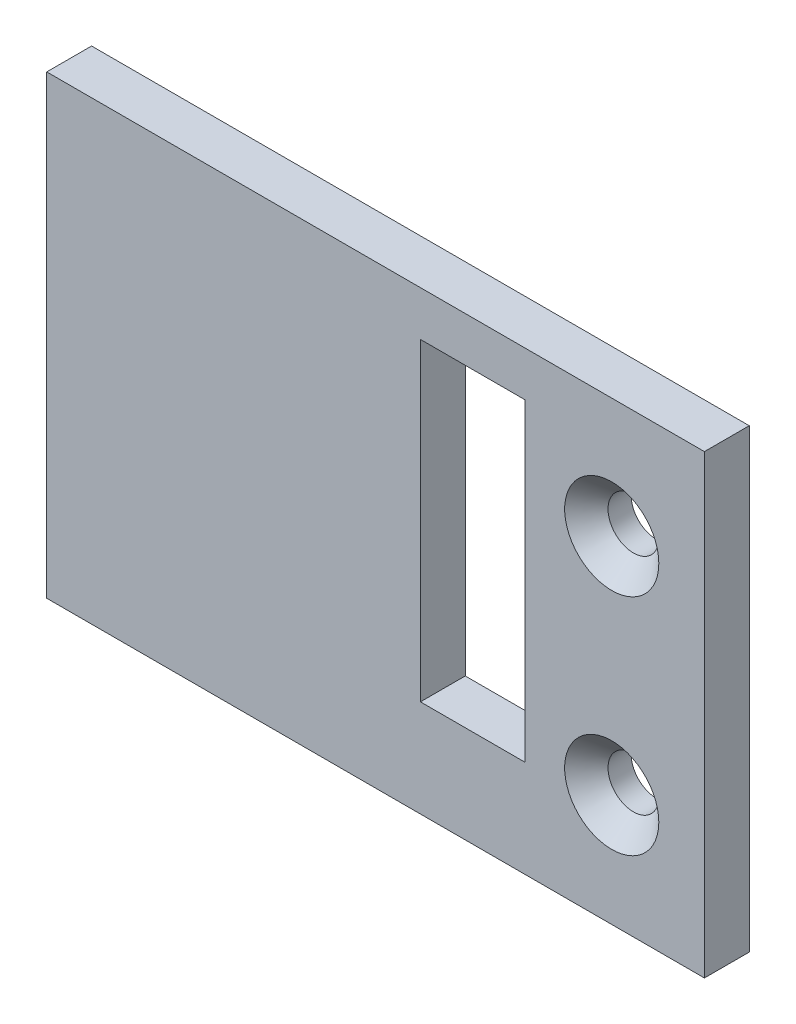
ISO-10303-21;
HEADER;
FILE_DESCRIPTION(('STEP AP214'),'2;1');
FILE_NAME('part.step','',(''),(''),'','','');
FILE_SCHEMA(('AUTOMOTIVE_DESIGN { 1 0 10303 214 1 1 1 1 }'));
ENDSEC;
DATA;
#1=APPLICATION_CONTEXT('core data for automotive mechanical design processes');
#2=APPLICATION_PROTOCOL_DEFINITION('international standard','automotive_design',2000,#1);
#3=PRODUCT_CONTEXT('',#1,'mechanical');
#4=PRODUCT('Part','Part','',(#3));
#5=PRODUCT_RELATED_PRODUCT_CATEGORY('part','',(#4));
#6=PRODUCT_DEFINITION_FORMATION('','',#4);
#7=PRODUCT_DEFINITION_CONTEXT('part definition',#1,'design');
#8=PRODUCT_DEFINITION('design','',#6,#7);
#9=PRODUCT_DEFINITION_SHAPE('','',#8);
#10=(LENGTH_UNIT() NAMED_UNIT(*) SI_UNIT(.MILLI.,.METRE.));
#11=(NAMED_UNIT(*) PLANE_ANGLE_UNIT() SI_UNIT($,.RADIAN.));
#12=(NAMED_UNIT(*) SI_UNIT($,.STERADIAN.) SOLID_ANGLE_UNIT());
#13=UNCERTAINTY_MEASURE_WITH_UNIT(LENGTH_MEASURE(1.E-05),#10,'distance_accuracy_value','');
#14=(GEOMETRIC_REPRESENTATION_CONTEXT(3) GLOBAL_UNCERTAINTY_ASSIGNED_CONTEXT((#13)) GLOBAL_UNIT_ASSIGNED_CONTEXT((#10,
#11,#12)) REPRESENTATION_CONTEXT('',''));
#15=CARTESIAN_POINT('',(0.,0.,0.));
#16=DIRECTION('',(0.,0.,1.));
#17=DIRECTION('',(1.,0.,0.));
#18=AXIS2_PLACEMENT_3D('',#15,#16,#17);
#19=CARTESIAN_POINT('',(6.00000000000003,0.,3.));
#20=DIRECTION('',(1.,0.,0.));
#21=DIRECTION('',(0.,0.,-1.));
#22=AXIS2_PLACEMENT_3D('',#19,#20,#21);
#23=PLANE('',#22);
#24=DIRECTION('',(0.,-1.,0.));
#25=VECTOR('',#24,1.);
#26=CARTESIAN_POINT('',(6.00000000000003,0.,0.));
#27=LINE('',#26,#25);
#28=CARTESIAN_POINT('',(6.00000000000003,15.2500000000001,0.));
#29=VERTEX_POINT('',#28);
#30=CARTESIAN_POINT('',(6.00000000000003,-15.2499999999999,0.));
#31=VERTEX_POINT('',#30);
#32=EDGE_CURVE('E140',#29,#31,#27,.T.);
#33=ORIENTED_EDGE('',*,*,#32,.F.);
#34=DIRECTION('',(0.,0.,-1.));
#35=VECTOR('',#34,1.);
#36=CARTESIAN_POINT('',(6.00000000000003,15.2500000000001,3.));
#37=LINE('',#36,#35);
#38=CARTESIAN_POINT('',(6.00000000000003,15.2500000000001,3.));
#39=VERTEX_POINT('',#38);
#40=EDGE_CURVE('E11',#39,#29,#37,.T.);
#41=ORIENTED_EDGE('',*,*,#40,.F.);
#42=DIRECTION('',(0.,-1.,0.));
#43=VECTOR('',#42,1.);
#44=CARTESIAN_POINT('',(6.00000000000003,0.,3.));
#45=LINE('',#44,#43);
#46=CARTESIAN_POINT('',(6.00000000000003,-15.2499999999999,3.));
#47=VERTEX_POINT('',#46);
#48=EDGE_CURVE('E112',#39,#47,#45,.T.);
#49=ORIENTED_EDGE('',*,*,#48,.T.);
#50=DIRECTION('',(0.,0.,-1.));
#51=VECTOR('',#50,1.);
#52=CARTESIAN_POINT('',(6.00000000000003,-15.2499999999999,3.));
#53=LINE('',#52,#51);
#54=EDGE_CURVE('E52',#47,#31,#53,.T.);
#55=ORIENTED_EDGE('',*,*,#54,.T.);
#56=EDGE_LOOP('',(#33,#41,#49,#55));
#57=FACE_BOUND('',#56,.T.);
#58=ADVANCED_FACE('F33',(#57),#23,.T.);
#59=CARTESIAN_POINT('',(0.,15.2500000000001,3.));
#60=DIRECTION('',(0.,-1.,0.));
#61=DIRECTION('',(1.,0.,0.));
#62=AXIS2_PLACEMENT_3D('',#59,#60,#61);
#63=PLANE('',#62);
#64=DIRECTION('',(-1.,0.,0.));
#65=VECTOR('',#64,1.);
#66=CARTESIAN_POINT('',(0.,15.2500000000001,0.));
#67=LINE('',#66,#65);
#68=CARTESIAN_POINT('',(-38.,15.2500000000001,0.));
#69=VERTEX_POINT('',#68);
#70=EDGE_CURVE('E118',#29,#69,#67,.T.);
#71=ORIENTED_EDGE('',*,*,#70,.T.);
#72=DIRECTION('',(0.,0.,-1.));
#73=VECTOR('',#72,1.);
#74=CARTESIAN_POINT('',(-38.,15.2500000000001,3.));
#75=LINE('',#74,#73);
#76=CARTESIAN_POINT('',(-38.,15.2500000000001,3.));
#77=VERTEX_POINT('',#76);
#78=EDGE_CURVE('E43',#77,#69,#75,.T.);
#79=ORIENTED_EDGE('',*,*,#78,.F.);
#80=DIRECTION('',(-1.,0.,0.));
#81=VECTOR('',#80,1.);
#82=CARTESIAN_POINT('',(0.,15.2500000000001,3.));
#83=LINE('',#82,#81);
#84=EDGE_CURVE('E106',#39,#77,#83,.T.);
#85=ORIENTED_EDGE('',*,*,#84,.F.);
#86=ORIENTED_EDGE('',*,*,#40,.T.);
#87=EDGE_LOOP('',(#71,#79,#85,#86));
#88=FACE_BOUND('',#87,.T.);
#89=ADVANCED_FACE('F116',(#88),#63,.F.);
#90=CARTESIAN_POINT('',(-38.,0.,3.));
#91=DIRECTION('',(-1.,0.,0.));
#92=DIRECTION('',(0.,0.,1.));
#93=AXIS2_PLACEMENT_3D('',#90,#91,#92);
#94=PLANE('',#93);
#95=DIRECTION('',(0.,1.,0.));
#96=VECTOR('',#95,1.);
#97=CARTESIAN_POINT('',(-38.,0.,0.));
#98=LINE('',#97,#96);
#99=CARTESIAN_POINT('',(-38.,-15.2499999999999,0.));
#100=VERTEX_POINT('',#99);
#101=EDGE_CURVE('E143',#100,#69,#98,.T.);
#102=ORIENTED_EDGE('',*,*,#101,.F.);
#103=DIRECTION('',(0.,0.,-1.));
#104=VECTOR('',#103,1.);
#105=CARTESIAN_POINT('',(-38.,-15.2499999999999,3.));
#106=LINE('',#105,#104);
#107=CARTESIAN_POINT('',(-38.,-15.2499999999999,3.));
#108=VERTEX_POINT('',#107);
#109=EDGE_CURVE('E77',#108,#100,#106,.T.);
#110=ORIENTED_EDGE('',*,*,#109,.F.);
#111=DIRECTION('',(0.,1.,0.));
#112=VECTOR('',#111,1.);
#113=CARTESIAN_POINT('',(-38.,0.,3.));
#114=LINE('',#113,#112);
#115=EDGE_CURVE('E111',#108,#77,#114,.T.);
#116=ORIENTED_EDGE('',*,*,#115,.T.);
#117=ORIENTED_EDGE('',*,*,#78,.T.);
#118=EDGE_LOOP('',(#102,#110,#116,#117));
#119=FACE_BOUND('',#118,.T.);
#120=ADVANCED_FACE('F122',(#119),#94,.T.);
#121=CARTESIAN_POINT('',(0.,12.2500000000001,3.));
#122=DIRECTION('',(0.,-1.,0.));
#123=DIRECTION('',(1.,0.,0.));
#124=AXIS2_PLACEMENT_3D('',#121,#122,#123);
#125=PLANE('',#124);
#126=DIRECTION('',(-1.,0.,0.));
#127=VECTOR('',#126,1.);
#128=CARTESIAN_POINT('',(0.,12.2500000000001,0.));
#129=LINE('',#128,#127);
#130=CARTESIAN_POINT('',(-5.99999999999997,12.2500000000001,0.));
#131=VERTEX_POINT('',#130);
#132=CARTESIAN_POINT('',(-13.,12.2500000000001,0.));
#133=VERTEX_POINT('',#132);
#134=EDGE_CURVE('E129',#131,#133,#129,.T.);
#135=ORIENTED_EDGE('',*,*,#134,.F.);
#136=DIRECTION('',(0.,0.,-1.));
#137=VECTOR('',#136,1.);
#138=CARTESIAN_POINT('',(-5.99999999999997,12.2500000000001,3.));
#139=LINE('',#138,#137);
#140=CARTESIAN_POINT('',(-5.99999999999997,12.2500000000001,3.));
#141=VERTEX_POINT('',#140);
#142=EDGE_CURVE('E37',#141,#131,#139,.T.);
#143=ORIENTED_EDGE('',*,*,#142,.F.);
#144=DIRECTION('',(-1.,0.,0.));
#145=VECTOR('',#144,1.);
#146=CARTESIAN_POINT('',(0.,12.2500000000001,3.));
#147=LINE('',#146,#145);
#148=CARTESIAN_POINT('',(-13.,12.2500000000001,3.));
#149=VERTEX_POINT('',#148);
#150=EDGE_CURVE('E148',#141,#149,#147,.T.);
#151=ORIENTED_EDGE('',*,*,#150,.T.);
#152=DIRECTION('',(0.,0.,-1.));
#153=VECTOR('',#152,1.);
#154=CARTESIAN_POINT('',(-13.,12.2500000000001,3.));
#155=LINE('',#154,#153);
#156=EDGE_CURVE('E125',#149,#133,#155,.T.);
#157=ORIENTED_EDGE('',*,*,#156,.T.);
#158=EDGE_LOOP('',(#135,#143,#151,#157));
#159=FACE_BOUND('',#158,.T.);
#160=ADVANCED_FACE('F35',(#159),#125,.T.);
#161=CARTESIAN_POINT('',(-5.99999999999995,0.,3.));
#162=DIRECTION('',(1.,0.,0.));
#163=DIRECTION('',(0.,1.,0.));
#164=AXIS2_PLACEMENT_3D('',#161,#162,#163);
#165=PLANE('',#164);
#166=DIRECTION('',(0.,-1.,0.));
#167=VECTOR('',#166,1.);
#168=CARTESIAN_POINT('',(-5.99999999999995,0.,0.));
#169=LINE('',#168,#167);
#170=CARTESIAN_POINT('',(-5.99999999999993,-8.74999999999988,0.));
#171=VERTEX_POINT('',#170);
#172=EDGE_CURVE('E132',#131,#171,#169,.T.);
#173=ORIENTED_EDGE('',*,*,#172,.T.);
#174=DIRECTION('',(0.,0.,-1.));
#175=VECTOR('',#174,1.);
#176=CARTESIAN_POINT('',(-5.99999999999993,-8.74999999999988,3.));
#177=LINE('',#176,#175);
#178=CARTESIAN_POINT('',(-5.99999999999993,-8.74999999999988,3.));
#179=VERTEX_POINT('',#178);
#180=EDGE_CURVE('E154',#179,#171,#177,.T.);
#181=ORIENTED_EDGE('',*,*,#180,.F.);
#182=DIRECTION('',(0.,-1.,0.));
#183=VECTOR('',#182,1.);
#184=CARTESIAN_POINT('',(-5.99999999999995,0.,3.));
#185=LINE('',#184,#183);
#186=EDGE_CURVE('E163',#141,#179,#185,.T.);
#187=ORIENTED_EDGE('',*,*,#186,.F.);
#188=ORIENTED_EDGE('',*,*,#142,.T.);
#189=EDGE_LOOP('',(#173,#181,#187,#188));
#190=FACE_BOUND('',#189,.T.);
#191=ADVANCED_FACE('F162',(#190),#165,.F.);
#192=CARTESIAN_POINT('',(0.,-8.74999999999988,3.));
#193=DIRECTION('',(0.,-1.,0.));
#194=DIRECTION('',(0.,0.,-1.));
#195=AXIS2_PLACEMENT_3D('',#192,#193,#194);
#196=PLANE('',#195);
#197=DIRECTION('',(-1.,0.,0.));
#198=VECTOR('',#197,1.);
#199=CARTESIAN_POINT('',(0.,-8.74999999999988,0.));
#200=LINE('',#199,#198);
#201=CARTESIAN_POINT('',(-13.,-8.74999999999988,0.));
#202=VERTEX_POINT('',#201);
#203=EDGE_CURVE('E135',#171,#202,#200,.T.);
#204=ORIENTED_EDGE('',*,*,#203,.T.);
#205=DIRECTION('',(0.,0.,-1.));
#206=VECTOR('',#205,1.);
#207=CARTESIAN_POINT('',(-13.,-8.74999999999988,3.));
#208=LINE('',#207,#206);
#209=CARTESIAN_POINT('',(-13.,-8.74999999999988,3.));
#210=VERTEX_POINT('',#209);
#211=EDGE_CURVE('E152',#210,#202,#208,.T.);
#212=ORIENTED_EDGE('',*,*,#211,.F.);
#213=DIRECTION('',(-1.,0.,0.));
#214=VECTOR('',#213,1.);
#215=CARTESIAN_POINT('',(0.,-8.74999999999988,3.));
#216=LINE('',#215,#214);
#217=EDGE_CURVE('E176',#179,#210,#216,.T.);
#218=ORIENTED_EDGE('',*,*,#217,.F.);
#219=ORIENTED_EDGE('',*,*,#180,.T.);
#220=EDGE_LOOP('',(#204,#212,#218,#219));
#221=FACE_BOUND('',#220,.T.);
#222=ADVANCED_FACE('F175',(#221),#196,.F.);
#223=CARTESIAN_POINT('',(0.,-15.2499999999999,3.));
#224=DIRECTION('',(0.,-1.,0.));
#225=DIRECTION('',(1.,0.,0.));
#226=AXIS2_PLACEMENT_3D('',#223,#224,#225);
#227=PLANE('',#226);
#228=DIRECTION('',(-1.,0.,0.));
#229=VECTOR('',#228,1.);
#230=CARTESIAN_POINT('',(0.,-15.2499999999999,0.));
#231=LINE('',#230,#229);
#232=EDGE_CURVE('E145',#31,#100,#231,.T.);
#233=ORIENTED_EDGE('',*,*,#232,.F.);
#234=ORIENTED_EDGE('',*,*,#54,.F.);
#235=DIRECTION('',(-1.,0.,0.));
#236=VECTOR('',#235,1.);
#237=CARTESIAN_POINT('',(0.,-15.2499999999999,3.));
#238=LINE('',#237,#236);
#239=EDGE_CURVE('E123',#47,#108,#238,.T.);
#240=ORIENTED_EDGE('',*,*,#239,.T.);
#241=ORIENTED_EDGE('',*,*,#109,.T.);
#242=EDGE_LOOP('',(#233,#234,#240,#241));
#243=FACE_BOUND('',#242,.T.);
#244=ADVANCED_FACE('F182',(#243),#227,.T.);
#245=CARTESIAN_POINT('',(-13.,0.,3.));
#246=DIRECTION('',(-1.,0.,0.));
#247=DIRECTION('',(0.,-1.,0.));
#248=AXIS2_PLACEMENT_3D('',#245,#246,#247);
#249=PLANE('',#248);
#250=DIRECTION('',(0.,1.,0.));
#251=VECTOR('',#250,1.);
#252=CARTESIAN_POINT('',(-13.,0.,0.));
#253=LINE('',#252,#251);
#254=EDGE_CURVE('E137',#202,#133,#253,.T.);
#255=ORIENTED_EDGE('',*,*,#254,.T.);
#256=ORIENTED_EDGE('',*,*,#156,.F.);
#257=DIRECTION('',(0.,1.,0.));
#258=VECTOR('',#257,1.);
#259=CARTESIAN_POINT('',(-13.,0.,3.));
#260=LINE('',#259,#258);
#261=EDGE_CURVE('E174',#210,#149,#260,.T.);
#262=ORIENTED_EDGE('',*,*,#261,.F.);
#263=ORIENTED_EDGE('',*,*,#211,.T.);
#264=EDGE_LOOP('',(#255,#256,#262,#263));
#265=FACE_BOUND('',#264,.T.);
#266=ADVANCED_FACE('F172',(#265),#249,.F.);
#267=CARTESIAN_POINT('',(0.,0.,3.));
#268=DIRECTION('',(0.,0.,1.));
#269=DIRECTION('',(1.,0.,0.));
#270=AXIS2_PLACEMENT_3D('',#267,#268,#269);
#271=PLANE('',#270);
#272=CARTESIAN_POINT('',(-0.199999999999966,7.25000000000012,3.));
#273=DIRECTION('',(0.,0.,1.));
#274=DIRECTION('',(1.,0.,0.));
#275=AXIS2_PLACEMENT_3D('',#272,#273,#274);
#276=CIRCLE('',#275,3.15);
#277=CARTESIAN_POINT('',(2.95000000000003,7.25000000000012,3.));
#278=VERTEX_POINT('',#277);
#279=EDGE_CURVE('E326',#278,#278,#276,.T.);
#280=ORIENTED_EDGE('',*,*,#279,.F.);
#281=EDGE_LOOP('',(#280));
#282=FACE_BOUND('',#281,.T.);
#283=CARTESIAN_POINT('',(-0.199999999999964,-7.74999999999987,3.));
#284=DIRECTION('',(0.,0.,1.));
#285=DIRECTION('',(1.,0.,0.));
#286=AXIS2_PLACEMENT_3D('',#283,#284,#285);
#287=CIRCLE('',#286,3.15);
#288=CARTESIAN_POINT('',(2.95000000000004,-7.74999999999987,3.));
#289=VERTEX_POINT('',#288);
#290=EDGE_CURVE('E333',#289,#289,#287,.T.);
#291=ORIENTED_EDGE('',*,*,#290,.F.);
#292=EDGE_LOOP('',(#291));
#293=FACE_BOUND('',#292,.T.);
#294=ORIENTED_EDGE('',*,*,#150,.F.);
#295=ORIENTED_EDGE('',*,*,#186,.T.);
#296=ORIENTED_EDGE('',*,*,#217,.T.);
#297=ORIENTED_EDGE('',*,*,#261,.T.);
#298=EDGE_LOOP('',(#294,#295,#296,#297));
#299=FACE_BOUND('',#298,.T.);
#300=ORIENTED_EDGE('',*,*,#48,.F.);
#301=ORIENTED_EDGE('',*,*,#84,.T.);
#302=ORIENTED_EDGE('',*,*,#115,.F.);
#303=ORIENTED_EDGE('',*,*,#239,.F.);
#304=EDGE_LOOP('',(#300,#301,#302,#303));
#305=FACE_BOUND('',#304,.T.);
#306=ADVANCED_FACE('F108',(#282,#293,#299,#305),#271,.T.);
#307=CARTESIAN_POINT('',(0.,0.,0.));
#308=DIRECTION('',(0.,0.,1.));
#309=DIRECTION('',(1.,0.,0.));
#310=AXIS2_PLACEMENT_3D('',#307,#308,#309);
#311=PLANE('',#310);
#312=CARTESIAN_POINT('',(-0.199999999999966,7.25000000000012,0.));
#313=DIRECTION('',(0.,0.,1.));
#314=DIRECTION('',(1.,0.,0.));
#315=AXIS2_PLACEMENT_3D('',#312,#313,#314);
#316=CIRCLE('',#315,1.7);
#317=CARTESIAN_POINT('',(1.50000000000003,7.25000000000012,0.));
#318=VERTEX_POINT('',#317);
#319=EDGE_CURVE('E328',#318,#318,#316,.T.);
#320=ORIENTED_EDGE('',*,*,#319,.T.);
#321=EDGE_LOOP('',(#320));
#322=FACE_BOUND('',#321,.T.);
#323=CARTESIAN_POINT('',(-0.199999999999964,-7.74999999999987,0.));
#324=DIRECTION('',(0.,0.,1.));
#325=DIRECTION('',(1.,0.,0.));
#326=AXIS2_PLACEMENT_3D('',#323,#324,#325);
#327=CIRCLE('',#326,1.7);
#328=CARTESIAN_POINT('',(1.50000000000003,-7.74999999999987,0.));
#329=VERTEX_POINT('',#328);
#330=EDGE_CURVE('E133',#329,#329,#327,.T.);
#331=ORIENTED_EDGE('',*,*,#330,.T.);
#332=EDGE_LOOP('',(#331));
#333=FACE_BOUND('',#332,.T.);
#334=ORIENTED_EDGE('',*,*,#134,.T.);
#335=ORIENTED_EDGE('',*,*,#254,.F.);
#336=ORIENTED_EDGE('',*,*,#203,.F.);
#337=ORIENTED_EDGE('',*,*,#172,.F.);
#338=EDGE_LOOP('',(#334,#335,#336,#337));
#339=FACE_BOUND('',#338,.T.);
#340=ORIENTED_EDGE('',*,*,#32,.T.);
#341=ORIENTED_EDGE('',*,*,#232,.T.);
#342=ORIENTED_EDGE('',*,*,#101,.T.);
#343=ORIENTED_EDGE('',*,*,#70,.F.);
#344=EDGE_LOOP('',(#340,#341,#342,#343));
#345=FACE_BOUND('',#344,.T.);
#346=ADVANCED_FACE('F166',(#322,#333,#339,#345),#311,.F.);
#347=CARTESIAN_POINT('',(-0.199999999999964,-7.74999999999987,3.));
#348=DIRECTION('',(0.,0.,1.));
#349=DIRECTION('',(1.,0.,0.));
#350=AXIS2_PLACEMENT_3D('',#347,#348,#349);
#351=CYLINDRICAL_SURFACE('',#350,1.7);
#352=ORIENTED_EDGE('',*,*,#330,.F.);
#353=EDGE_LOOP('',(#352));
#354=FACE_BOUND('',#353,.T.);
#355=CARTESIAN_POINT('',(-0.199999999999964,-7.74999999999987,1.55));
#356=DIRECTION('',(0.,0.,1.));
#357=DIRECTION('',(1.,0.,0.));
#358=AXIS2_PLACEMENT_3D('',#355,#356,#357);
#359=CIRCLE('',#358,1.7);
#360=CARTESIAN_POINT('',(1.50000000000004,-7.74999999999987,1.55));
#361=VERTEX_POINT('',#360);
#362=EDGE_CURVE('E336',#361,#361,#359,.T.);
#363=ORIENTED_EDGE('',*,*,#362,.T.);
#364=EDGE_LOOP('',(#363));
#365=FACE_BOUND('',#364,.T.);
#366=ADVANCED_FACE('F273',(#354,#365),#351,.F.);
#367=CARTESIAN_POINT('',(-0.199999999999964,-7.74999999999987,3.));
#368=DIRECTION('',(0.,0.,1.));
#369=DIRECTION('',(1.,0.,0.));
#370=AXIS2_PLACEMENT_3D('',#367,#368,#369);
#371=CONICAL_SURFACE('',#370,3.15,0.785398163397447);
#372=ORIENTED_EDGE('',*,*,#362,.F.);
#373=EDGE_LOOP('',(#372));
#374=FACE_BOUND('',#373,.T.);
#375=ORIENTED_EDGE('',*,*,#290,.T.);
#376=EDGE_LOOP('',(#375));
#377=FACE_BOUND('',#376,.T.);
#378=ADVANCED_FACE('F284',(#374,#377),#371,.F.);
#379=CARTESIAN_POINT('',(-0.199999999999966,7.25000000000012,3.));
#380=DIRECTION('',(0.,0.,1.));
#381=DIRECTION('',(1.,0.,0.));
#382=AXIS2_PLACEMENT_3D('',#379,#380,#381);
#383=CYLINDRICAL_SURFACE('',#382,1.7);
#384=ORIENTED_EDGE('',*,*,#319,.F.);
#385=EDGE_LOOP('',(#384));
#386=FACE_BOUND('',#385,.T.);
#387=CARTESIAN_POINT('',(-0.199999999999966,7.25000000000012,1.55));
#388=DIRECTION('',(0.,0.,1.));
#389=DIRECTION('',(1.,0.,0.));
#390=AXIS2_PLACEMENT_3D('',#387,#388,#389);
#391=CIRCLE('',#390,1.7);
#392=CARTESIAN_POINT('',(1.50000000000003,7.25000000000012,1.55));
#393=VERTEX_POINT('',#392);
#394=EDGE_CURVE('E323',#393,#393,#391,.T.);
#395=ORIENTED_EDGE('',*,*,#394,.T.);
#396=EDGE_LOOP('',(#395));
#397=FACE_BOUND('',#396,.T.);
#398=ADVANCED_FACE('F293',(#386,#397),#383,.F.);
#399=CARTESIAN_POINT('',(-0.199999999999966,7.25000000000012,3.));
#400=DIRECTION('',(0.,0.,1.));
#401=DIRECTION('',(1.,0.,0.));
#402=AXIS2_PLACEMENT_3D('',#399,#400,#401);
#403=CONICAL_SURFACE('',#402,3.15,0.785398163397447);
#404=ORIENTED_EDGE('',*,*,#394,.F.);
#405=EDGE_LOOP('',(#404));
#406=FACE_BOUND('',#405,.T.);
#407=ORIENTED_EDGE('',*,*,#279,.T.);
#408=EDGE_LOOP('',(#407));
#409=FACE_BOUND('',#408,.T.);
#410=ADVANCED_FACE('F302',(#406,#409),#403,.F.);
#411=CLOSED_SHELL('',(#58,#89,#120,#160,#191,#222,#244,#266,#306,#346,#366,#378,#398,#410));
#412=MANIFOLD_SOLID_BREP('B2',#411);
#413=ADVANCED_BREP_SHAPE_REPRESENTATION('',(#18,#412),#14);
#414=SHAPE_DEFINITION_REPRESENTATION(#9,#413);
ENDSEC;
END-ISO-10303-21;
